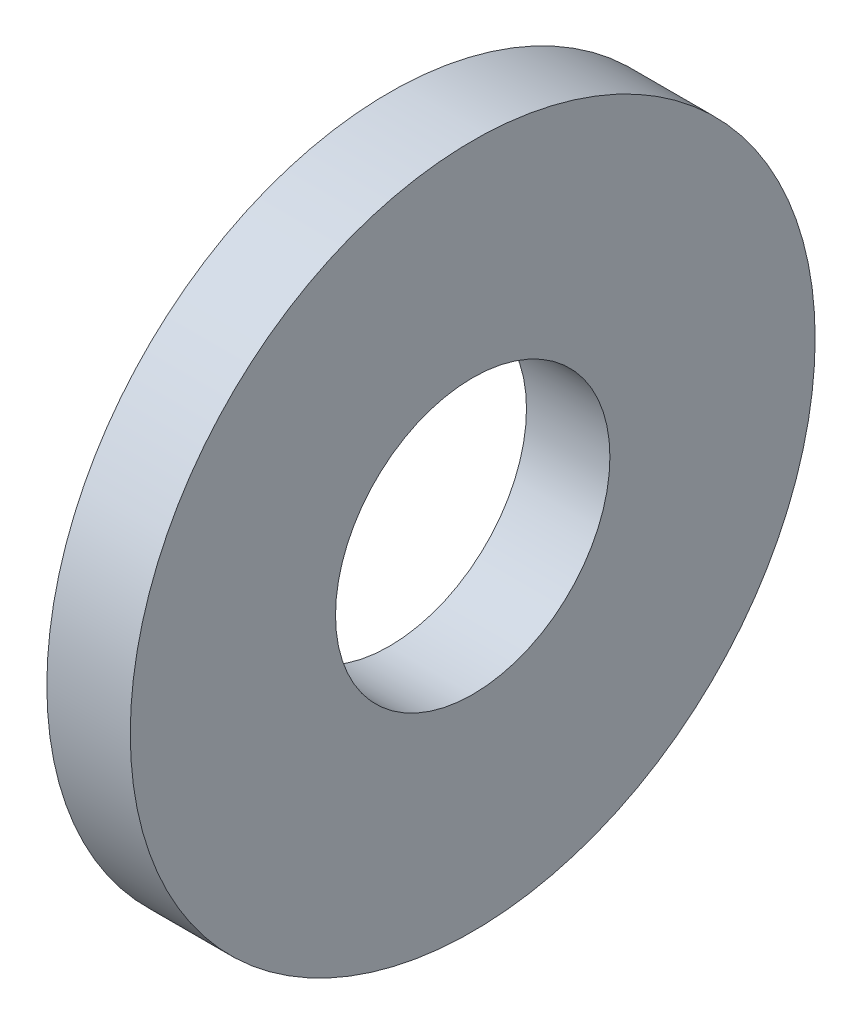
ISO-10303-21;
HEADER;
FILE_DESCRIPTION(('STEP AP214'),'2;1');
FILE_NAME('part.step','',(''),(''),'','','');
FILE_SCHEMA(('AUTOMOTIVE_DESIGN { 1 0 10303 214 1 1 1 1 }'));
ENDSEC;
DATA;
#1=APPLICATION_CONTEXT('core data for automotive mechanical design processes');
#2=APPLICATION_PROTOCOL_DEFINITION('international standard','automotive_design',2000,#1);
#3=PRODUCT_CONTEXT('',#1,'mechanical');
#4=PRODUCT('Part','Part','',(#3));
#5=PRODUCT_RELATED_PRODUCT_CATEGORY('part','',(#4));
#6=PRODUCT_DEFINITION_FORMATION('','',#4);
#7=PRODUCT_DEFINITION_CONTEXT('part definition',#1,'design');
#8=PRODUCT_DEFINITION('design','',#6,#7);
#9=PRODUCT_DEFINITION_SHAPE('','',#8);
#10=(LENGTH_UNIT() NAMED_UNIT(*) SI_UNIT(.MILLI.,.METRE.));
#11=(NAMED_UNIT(*) PLANE_ANGLE_UNIT() SI_UNIT($,.RADIAN.));
#12=(NAMED_UNIT(*) SI_UNIT($,.STERADIAN.) SOLID_ANGLE_UNIT());
#13=UNCERTAINTY_MEASURE_WITH_UNIT(LENGTH_MEASURE(1.E-05),#10,'distance_accuracy_value','');
#14=(GEOMETRIC_REPRESENTATION_CONTEXT(3) GLOBAL_UNCERTAINTY_ASSIGNED_CONTEXT((#13)) GLOBAL_UNIT_ASSIGNED_CONTEXT((#10,
#11,#12)) REPRESENTATION_CONTEXT('',''));
#15=CARTESIAN_POINT('',(0.,0.,0.));
#16=DIRECTION('',(0.,0.,1.));
#17=DIRECTION('',(1.,0.,0.));
#18=AXIS2_PLACEMENT_3D('',#15,#16,#17);
#19=CARTESIAN_POINT('',(0.9652,0.,0.));
#20=DIRECTION('',(1.,0.,0.));
#21=DIRECTION('',(0.,0.,-1.));
#22=AXIS2_PLACEMENT_3D('',#19,#20,#21);
#23=PLANE('',#22);
#24=CARTESIAN_POINT('',(0.9652,0.,0.));
#25=DIRECTION('',(1.,0.,0.));
#26=DIRECTION('',(0.,0.,-1.));
#27=AXIS2_PLACEMENT_3D('',#24,#25,#26);
#28=CIRCLE('',#27,3.9624);
#29=CARTESIAN_POINT('',(0.9652,0.,-3.9624));
#30=VERTEX_POINT('',#29);
#31=EDGE_CURVE('E10',#30,#30,#28,.T.);
#32=ORIENTED_EDGE('',*,*,#31,.T.);
#33=EDGE_LOOP('',(#32));
#34=FACE_BOUND('',#33,.T.);
#35=CARTESIAN_POINT('',(0.9652,0.,0.));
#36=DIRECTION('',(1.,0.,0.));
#37=DIRECTION('',(0.,0.,-1.));
#38=AXIS2_PLACEMENT_3D('',#35,#36,#37);
#39=CIRCLE('',#38,1.5875);
#40=CARTESIAN_POINT('',(0.9652,0.,-1.5875));
#41=VERTEX_POINT('',#40);
#42=EDGE_CURVE('E40',#41,#41,#39,.T.);
#43=ORIENTED_EDGE('',*,*,#42,.F.);
#44=EDGE_LOOP('',(#43));
#45=FACE_BOUND('',#44,.T.);
#46=ADVANCED_FACE('F29',(#34,#45),#23,.T.);
#47=CARTESIAN_POINT('',(0.,0.,0.));
#48=DIRECTION('',(1.,0.,0.));
#49=DIRECTION('',(0.,0.,-1.));
#50=AXIS2_PLACEMENT_3D('',#47,#48,#49);
#51=PLANE('',#50);
#52=CARTESIAN_POINT('',(0.,0.,0.));
#53=DIRECTION('',(1.,0.,0.));
#54=DIRECTION('',(0.,0.,-1.));
#55=AXIS2_PLACEMENT_3D('',#52,#53,#54);
#56=CIRCLE('',#55,3.9624);
#57=CARTESIAN_POINT('',(0.,0.,-3.9624));
#58=VERTEX_POINT('',#57);
#59=EDGE_CURVE('E33',#58,#58,#56,.T.);
#60=ORIENTED_EDGE('',*,*,#59,.F.);
#61=EDGE_LOOP('',(#60));
#62=FACE_BOUND('',#61,.T.);
#63=CARTESIAN_POINT('',(0.,0.,0.));
#64=DIRECTION('',(1.,0.,0.));
#65=DIRECTION('',(0.,0.,-1.));
#66=AXIS2_PLACEMENT_3D('',#63,#64,#65);
#67=CIRCLE('',#66,1.5875);
#68=CARTESIAN_POINT('',(0.,0.,-1.5875));
#69=VERTEX_POINT('',#68);
#70=EDGE_CURVE('E42',#69,#69,#67,.T.);
#71=ORIENTED_EDGE('',*,*,#70,.T.);
#72=EDGE_LOOP('',(#71));
#73=FACE_BOUND('',#72,.T.);
#74=ADVANCED_FACE('F52',(#62,#73),#51,.F.);
#75=CARTESIAN_POINT('',(0.9652,0.,0.));
#76=DIRECTION('',(-1.,0.,0.));
#77=DIRECTION('',(0.,0.,1.));
#78=AXIS2_PLACEMENT_3D('',#75,#76,#77);
#79=CYLINDRICAL_SURFACE('',#78,3.9624);
#80=ORIENTED_EDGE('',*,*,#31,.F.);
#81=EDGE_LOOP('',(#80));
#82=FACE_BOUND('',#81,.T.);
#83=ORIENTED_EDGE('',*,*,#59,.T.);
#84=EDGE_LOOP('',(#83));
#85=FACE_BOUND('',#84,.T.);
#86=ADVANCED_FACE('F31',(#82,#85),#79,.T.);
#87=CARTESIAN_POINT('',(0.9652,0.,0.));
#88=DIRECTION('',(-1.,0.,0.));
#89=DIRECTION('',(0.,0.,1.));
#90=AXIS2_PLACEMENT_3D('',#87,#88,#89);
#91=CYLINDRICAL_SURFACE('',#90,1.5875);
#92=ORIENTED_EDGE('',*,*,#42,.T.);
#93=EDGE_LOOP('',(#92));
#94=FACE_BOUND('',#93,.T.);
#95=ORIENTED_EDGE('',*,*,#70,.F.);
#96=EDGE_LOOP('',(#95));
#97=FACE_BOUND('',#96,.T.);
#98=ADVANCED_FACE('F48',(#94,#97),#91,.F.);
#99=CLOSED_SHELL('',(#46,#74,#86,#98));
#100=MANIFOLD_SOLID_BREP('B2',#99);
#101=ADVANCED_BREP_SHAPE_REPRESENTATION('',(#18,#100),#14);
#102=SHAPE_DEFINITION_REPRESENTATION(#9,#101);
ENDSEC;
END-ISO-10303-21;
